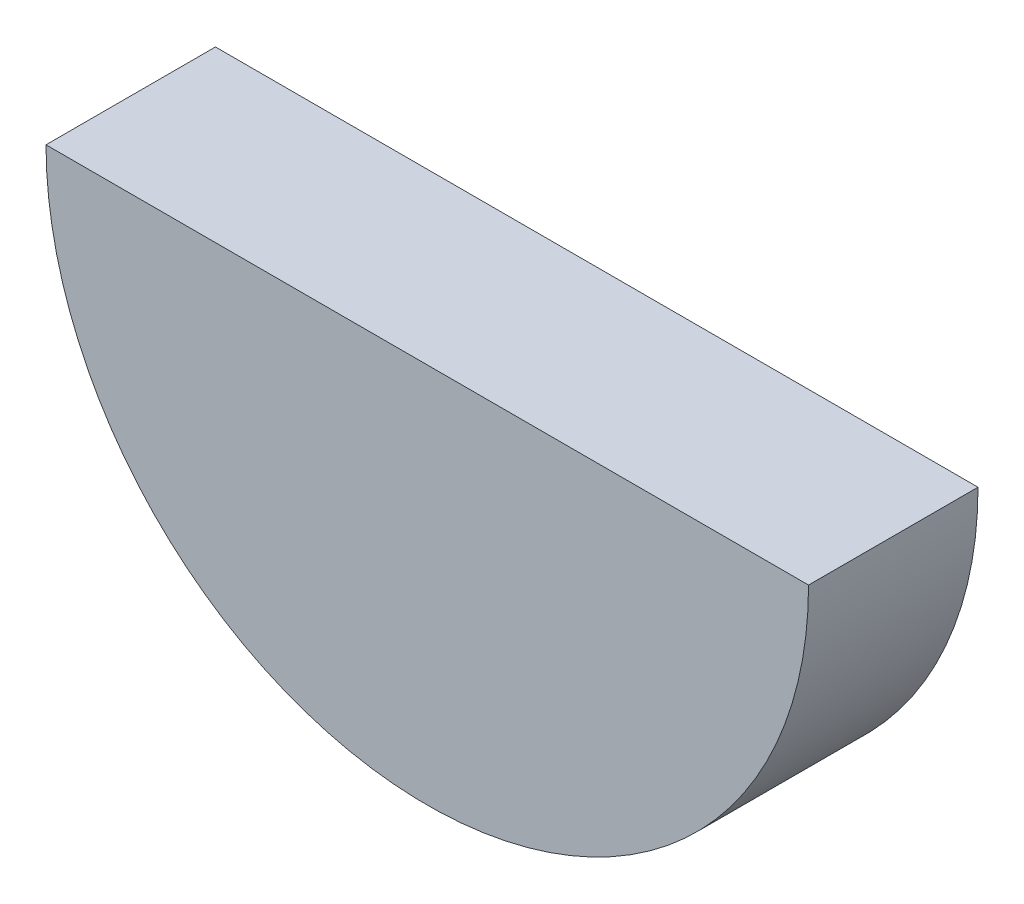
ISO-10303-21;
HEADER;
FILE_DESCRIPTION(('STEP AP214'),'2;1');
FILE_NAME('part.step','',(''),(''),'','','');
FILE_SCHEMA(('AUTOMOTIVE_DESIGN { 1 0 10303 214 1 1 1 1 }'));
ENDSEC;
DATA;
#1=APPLICATION_CONTEXT('core data for automotive mechanical design processes');
#2=APPLICATION_PROTOCOL_DEFINITION('international standard','automotive_design',2000,#1);
#3=PRODUCT_CONTEXT('',#1,'mechanical');
#4=PRODUCT('Part','Part','',(#3));
#5=PRODUCT_RELATED_PRODUCT_CATEGORY('part','',(#4));
#6=PRODUCT_DEFINITION_FORMATION('','',#4);
#7=PRODUCT_DEFINITION_CONTEXT('part definition',#1,'design');
#8=PRODUCT_DEFINITION('design','',#6,#7);
#9=PRODUCT_DEFINITION_SHAPE('','',#8);
#10=(LENGTH_UNIT() NAMED_UNIT(*) SI_UNIT(.MILLI.,.METRE.));
#11=(NAMED_UNIT(*) PLANE_ANGLE_UNIT() SI_UNIT($,.RADIAN.));
#12=(NAMED_UNIT(*) SI_UNIT($,.STERADIAN.) SOLID_ANGLE_UNIT());
#13=UNCERTAINTY_MEASURE_WITH_UNIT(LENGTH_MEASURE(1.E-05),#10,'distance_accuracy_value','');
#14=(GEOMETRIC_REPRESENTATION_CONTEXT(3) GLOBAL_UNCERTAINTY_ASSIGNED_CONTEXT((#13)) GLOBAL_UNIT_ASSIGNED_CONTEXT((#10,
#11,#12)) REPRESENTATION_CONTEXT('',''));
#15=CARTESIAN_POINT('',(0.,0.,0.));
#16=DIRECTION('',(0.,0.,1.));
#17=DIRECTION('',(1.,0.,0.));
#18=AXIS2_PLACEMENT_3D('',#15,#16,#17);
#19=CARTESIAN_POINT('',(0.,0.,25.4));
#20=DIRECTION('',(0.,0.,-1.));
#21=DIRECTION('',(-1.,0.,0.));
#22=AXIS2_PLACEMENT_3D('',#19,#20,#21);
#23=CYLINDRICAL_SURFACE('',#22,57.15);
#24=CARTESIAN_POINT('',(0.,0.,0.));
#25=DIRECTION('',(0.,0.,1.));
#26=DIRECTION('',(1.,0.,0.));
#27=AXIS2_PLACEMENT_3D('',#24,#25,#26);
#28=CIRCLE('',#27,57.15);
#29=CARTESIAN_POINT('',(-57.15,0.,0.));
#30=VERTEX_POINT('',#29);
#31=CARTESIAN_POINT('',(57.15,0.,0.));
#32=VERTEX_POINT('',#31);
#33=EDGE_CURVE('E75',#30,#32,#28,.T.);
#34=ORIENTED_EDGE('',*,*,#33,.T.);
#35=DIRECTION('',(0.,0.,-1.));
#36=VECTOR('',#35,1.);
#37=CARTESIAN_POINT('',(57.15,0.,25.4));
#38=LINE('',#37,#36);
#39=CARTESIAN_POINT('',(57.15,0.,25.4));
#40=VERTEX_POINT('',#39);
#41=EDGE_CURVE('E11',#40,#32,#38,.T.);
#42=ORIENTED_EDGE('',*,*,#41,.F.);
#43=CARTESIAN_POINT('',(0.,0.,25.4));
#44=DIRECTION('',(0.,0.,1.));
#45=DIRECTION('',(1.,0.,0.));
#46=AXIS2_PLACEMENT_3D('',#43,#44,#45);
#47=CIRCLE('',#46,57.15);
#48=CARTESIAN_POINT('',(-57.15,0.,25.4));
#49=VERTEX_POINT('',#48);
#50=EDGE_CURVE('E74',#49,#40,#47,.T.);
#51=ORIENTED_EDGE('',*,*,#50,.F.);
#52=DIRECTION('',(0.,0.,-1.));
#53=VECTOR('',#52,1.);
#54=CARTESIAN_POINT('',(-57.15,0.,25.4));
#55=LINE('',#54,#53);
#56=EDGE_CURVE('E47',#49,#30,#55,.T.);
#57=ORIENTED_EDGE('',*,*,#56,.T.);
#58=EDGE_LOOP('',(#34,#42,#51,#57));
#59=FACE_BOUND('',#58,.T.);
#60=ADVANCED_FACE('F38',(#59),#23,.T.);
#61=CARTESIAN_POINT('',(-57.15,0.,25.4));
#62=DIRECTION('',(0.,-1.,0.));
#63=DIRECTION('',(0.,0.,-1.));
#64=AXIS2_PLACEMENT_3D('',#61,#62,#63);
#65=PLANE('',#64);
#66=DIRECTION('',(-1.,0.,0.));
#67=VECTOR('',#66,1.);
#68=CARTESIAN_POINT('',(-57.15,0.,0.));
#69=LINE('',#68,#67);
#70=EDGE_CURVE('E65',#32,#30,#69,.T.);
#71=ORIENTED_EDGE('',*,*,#70,.T.);
#72=ORIENTED_EDGE('',*,*,#56,.F.);
#73=DIRECTION('',(-1.,0.,0.));
#74=VECTOR('',#73,1.);
#75=CARTESIAN_POINT('',(-57.15,0.,25.4));
#76=LINE('',#75,#74);
#77=EDGE_CURVE('E56',#40,#49,#76,.T.);
#78=ORIENTED_EDGE('',*,*,#77,.F.);
#79=ORIENTED_EDGE('',*,*,#41,.T.);
#80=EDGE_LOOP('',(#71,#72,#78,#79));
#81=FACE_BOUND('',#80,.T.);
#82=ADVANCED_FACE('F69',(#81),#65,.F.);
#83=CARTESIAN_POINT('',(0.,0.,25.4));
#84=DIRECTION('',(0.,0.,1.));
#85=DIRECTION('',(1.,0.,0.));
#86=AXIS2_PLACEMENT_3D('',#83,#84,#85);
#87=PLANE('',#86);
#88=ORIENTED_EDGE('',*,*,#50,.T.);
#89=ORIENTED_EDGE('',*,*,#77,.T.);
#90=EDGE_LOOP('',(#88,#89));
#91=FACE_BOUND('',#90,.T.);
#92=ADVANCED_FACE('F86',(#91),#87,.T.);
#93=CARTESIAN_POINT('',(0.,0.,0.));
#94=DIRECTION('',(0.,0.,1.));
#95=DIRECTION('',(1.,0.,0.));
#96=AXIS2_PLACEMENT_3D('',#93,#94,#95);
#97=PLANE('',#96);
#98=ORIENTED_EDGE('',*,*,#33,.F.);
#99=ORIENTED_EDGE('',*,*,#70,.F.);
#100=EDGE_LOOP('',(#98,#99));
#101=FACE_BOUND('',#100,.T.);
#102=ADVANCED_FACE('F79',(#101),#97,.F.);
#103=CLOSED_SHELL('',(#60,#82,#92,#102));
#104=MANIFOLD_SOLID_BREP('B2',#103);
#105=ADVANCED_BREP_SHAPE_REPRESENTATION('',(#18,#104),#14);
#106=SHAPE_DEFINITION_REPRESENTATION(#9,#105);
ENDSEC;
END-ISO-10303-21;
